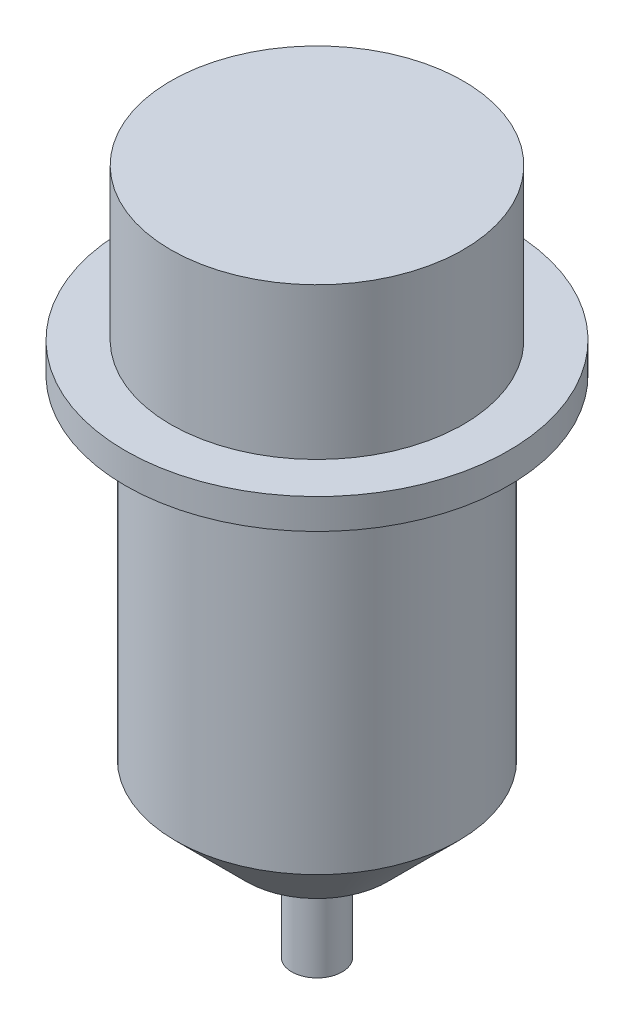
ISO-10303-21;
HEADER;
FILE_DESCRIPTION(('STEP AP214'),'2;1');
FILE_NAME('part.step','',(''),(''),'','','');
FILE_SCHEMA(('AUTOMOTIVE_DESIGN { 1 0 10303 214 1 1 1 1 }'));
ENDSEC;
DATA;
#1=APPLICATION_CONTEXT('core data for automotive mechanical design processes');
#2=APPLICATION_PROTOCOL_DEFINITION('international standard','automotive_design',2000,#1);
#3=PRODUCT_CONTEXT('',#1,'mechanical');
#4=PRODUCT('Part','Part','',(#3));
#5=PRODUCT_RELATED_PRODUCT_CATEGORY('part','',(#4));
#6=PRODUCT_DEFINITION_FORMATION('','',#4);
#7=PRODUCT_DEFINITION_CONTEXT('part definition',#1,'design');
#8=PRODUCT_DEFINITION('design','',#6,#7);
#9=PRODUCT_DEFINITION_SHAPE('','',#8);
#10=(LENGTH_UNIT() NAMED_UNIT(*) SI_UNIT(.MILLI.,.METRE.));
#11=(NAMED_UNIT(*) PLANE_ANGLE_UNIT() SI_UNIT($,.RADIAN.));
#12=(NAMED_UNIT(*) SI_UNIT($,.STERADIAN.) SOLID_ANGLE_UNIT());
#13=UNCERTAINTY_MEASURE_WITH_UNIT(LENGTH_MEASURE(1.E-05),#10,'distance_accuracy_value','');
#14=(GEOMETRIC_REPRESENTATION_CONTEXT(3) GLOBAL_UNCERTAINTY_ASSIGNED_CONTEXT((#13)) GLOBAL_UNIT_ASSIGNED_CONTEXT((#10,
#11,#12)) REPRESENTATION_CONTEXT('',''));
#15=CARTESIAN_POINT('',(0.,0.,0.));
#16=DIRECTION('',(0.,0.,1.));
#17=DIRECTION('',(1.,0.,0.));
#18=AXIS2_PLACEMENT_3D('',#15,#16,#17);
#19=CARTESIAN_POINT('',(0.,-40.,0.));
#20=DIRECTION('',(0.,1.,0.));
#21=DIRECTION('',(0.,0.,1.));
#22=AXIS2_PLACEMENT_3D('',#19,#20,#21);
#23=CYLINDRICAL_SURFACE('',#22,14.);
#24=CARTESIAN_POINT('',(0.,-33.,0.));
#25=DIRECTION('',(0.,1.,0.));
#26=DIRECTION('',(0.,0.,1.));
#27=AXIS2_PLACEMENT_3D('',#24,#25,#26);
#28=CIRCLE('',#27,14.);
#29=CARTESIAN_POINT('',(0.,-33.,14.));
#30=VERTEX_POINT('',#29);
#31=EDGE_CURVE('E71',#30,#30,#28,.T.);
#32=ORIENTED_EDGE('',*,*,#31,.T.);
#33=EDGE_LOOP('',(#32));
#34=FACE_BOUND('',#33,.T.);
#35=CARTESIAN_POINT('',(0.,0.,0.));
#36=DIRECTION('',(0.,1.,0.));
#37=DIRECTION('',(0.,0.,1.));
#38=AXIS2_PLACEMENT_3D('',#35,#36,#37);
#39=CIRCLE('',#38,14.);
#40=CARTESIAN_POINT('',(0.,0.,14.));
#41=VERTEX_POINT('',#40);
#42=EDGE_CURVE('E65',#41,#41,#39,.T.);
#43=ORIENTED_EDGE('',*,*,#42,.F.);
#44=EDGE_LOOP('',(#43));
#45=FACE_BOUND('',#44,.T.);
#46=ADVANCED_FACE('F37',(#34,#45),#23,.T.);
#47=CARTESIAN_POINT('',(0.,-40.,0.));
#48=DIRECTION('',(0.,1.,0.));
#49=DIRECTION('',(0.,0.,1.));
#50=AXIS2_PLACEMENT_3D('',#47,#48,#49);
#51=PLANE('',#50);
#52=CARTESIAN_POINT('',(0.,-40.,0.));
#53=DIRECTION('',(0.,-1.,0.));
#54=DIRECTION('',(0.,0.,-1.));
#55=AXIS2_PLACEMENT_3D('',#52,#53,#54);
#56=CIRCLE('',#55,2.5);
#57=CARTESIAN_POINT('',(0.,-40.,-2.5));
#58=VERTEX_POINT('',#57);
#59=EDGE_CURVE('E10',#58,#58,#56,.T.);
#60=ORIENTED_EDGE('',*,*,#59,.F.);
#61=EDGE_LOOP('',(#60));
#62=FACE_BOUND('',#61,.T.);
#63=CARTESIAN_POINT('',(0.,-40.,0.));
#64=DIRECTION('',(0.,1.,0.));
#65=DIRECTION('',(0.,0.,1.));
#66=AXIS2_PLACEMENT_3D('',#63,#64,#65);
#67=CIRCLE('',#66,6.99999999999998);
#68=CARTESIAN_POINT('',(0.,-40.,6.99999999999998));
#69=VERTEX_POINT('',#68);
#70=EDGE_CURVE('E41',#69,#69,#67,.F.);
#71=ORIENTED_EDGE('',*,*,#70,.T.);
#72=EDGE_LOOP('',(#71));
#73=FACE_BOUND('',#72,.T.);
#74=ADVANCED_FACE('F80',(#62,#73),#51,.F.);
#75=CARTESIAN_POINT('',(0.,-33.,0.));
#76=DIRECTION('',(0.,1.,0.));
#77=DIRECTION('',(0.,0.,1.));
#78=AXIS2_PLACEMENT_3D('',#75,#76,#77);
#79=CONICAL_SURFACE('',#78,14.,0.78539816339745);
#80=ORIENTED_EDGE('',*,*,#70,.F.);
#81=EDGE_LOOP('',(#80));
#82=FACE_BOUND('',#81,.T.);
#83=ORIENTED_EDGE('',*,*,#31,.F.);
#84=EDGE_LOOP('',(#83));
#85=FACE_BOUND('',#84,.T.);
#86=ADVANCED_FACE('F39',(#82,#85),#79,.T.);
#87=CARTESIAN_POINT('',(0.,3.,0.));
#88=DIRECTION('',(0.,-1.,0.));
#89=DIRECTION('',(0.,0.,-1.));
#90=AXIS2_PLACEMENT_3D('',#87,#88,#89);
#91=CYLINDRICAL_SURFACE('',#90,19.);
#92=CARTESIAN_POINT('',(0.,3.,0.));
#93=DIRECTION('',(0.,1.,0.));
#94=DIRECTION('',(0.,0.,1.));
#95=AXIS2_PLACEMENT_3D('',#92,#93,#94);
#96=CIRCLE('',#95,19.);
#97=CARTESIAN_POINT('',(0.,3.,19.));
#98=VERTEX_POINT('',#97);
#99=EDGE_CURVE('E61',#98,#98,#96,.T.);
#100=ORIENTED_EDGE('',*,*,#99,.F.);
#101=EDGE_LOOP('',(#100));
#102=FACE_BOUND('',#101,.T.);
#103=CARTESIAN_POINT('',(0.,0.,0.));
#104=DIRECTION('',(0.,1.,0.));
#105=DIRECTION('',(0.,0.,1.));
#106=AXIS2_PLACEMENT_3D('',#103,#104,#105);
#107=CIRCLE('',#106,19.);
#108=CARTESIAN_POINT('',(0.,0.,19.));
#109=VERTEX_POINT('',#108);
#110=EDGE_CURVE('E59',#109,#109,#107,.T.);
#111=ORIENTED_EDGE('',*,*,#110,.T.);
#112=EDGE_LOOP('',(#111));
#113=FACE_BOUND('',#112,.T.);
#114=ADVANCED_FACE('F84',(#102,#113),#91,.T.);
#115=CARTESIAN_POINT('',(0.,3.,0.));
#116=DIRECTION('',(0.,1.,0.));
#117=DIRECTION('',(0.,0.,1.));
#118=AXIS2_PLACEMENT_3D('',#115,#116,#117);
#119=PLANE('',#118);
#120=CARTESIAN_POINT('',(0.,3.,0.));
#121=DIRECTION('',(0.,1.,0.));
#122=DIRECTION('',(0.,0.,1.));
#123=AXIS2_PLACEMENT_3D('',#120,#121,#122);
#124=CIRCLE('',#123,14.5);
#125=CARTESIAN_POINT('',(0.,3.,14.5));
#126=VERTEX_POINT('',#125);
#127=EDGE_CURVE('E46',#126,#126,#124,.T.);
#128=ORIENTED_EDGE('',*,*,#127,.F.);
#129=EDGE_LOOP('',(#128));
#130=FACE_BOUND('',#129,.T.);
#131=ORIENTED_EDGE('',*,*,#99,.T.);
#132=EDGE_LOOP('',(#131));
#133=FACE_BOUND('',#132,.T.);
#134=ADVANCED_FACE('F89',(#130,#133),#119,.T.);
#135=CARTESIAN_POINT('',(0.,0.,0.));
#136=DIRECTION('',(0.,1.,0.));
#137=DIRECTION('',(0.,0.,1.));
#138=AXIS2_PLACEMENT_3D('',#135,#136,#137);
#139=PLANE('',#138);
#140=ORIENTED_EDGE('',*,*,#42,.T.);
#141=EDGE_LOOP('',(#140));
#142=FACE_BOUND('',#141,.T.);
#143=ORIENTED_EDGE('',*,*,#110,.F.);
#144=EDGE_LOOP('',(#143));
#145=FACE_BOUND('',#144,.T.);
#146=ADVANCED_FACE('F99',(#142,#145),#139,.F.);
#147=CARTESIAN_POINT('',(0.,18.,0.));
#148=DIRECTION('',(0.,-1.,0.));
#149=DIRECTION('',(0.,0.,-1.));
#150=AXIS2_PLACEMENT_3D('',#147,#148,#149);
#151=CYLINDRICAL_SURFACE('',#150,14.5);
#152=CARTESIAN_POINT('',(0.,18.,0.));
#153=DIRECTION('',(0.,1.,0.));
#154=DIRECTION('',(0.,0.,1.));
#155=AXIS2_PLACEMENT_3D('',#152,#153,#154);
#156=CIRCLE('',#155,14.5);
#157=CARTESIAN_POINT('',(0.,18.,14.5));
#158=VERTEX_POINT('',#157);
#159=EDGE_CURVE('E56',#158,#158,#156,.T.);
#160=ORIENTED_EDGE('',*,*,#159,.F.);
#161=EDGE_LOOP('',(#160));
#162=FACE_BOUND('',#161,.T.);
#163=ORIENTED_EDGE('',*,*,#127,.T.);
#164=EDGE_LOOP('',(#163));
#165=FACE_BOUND('',#164,.T.);
#166=ADVANCED_FACE('F102',(#162,#165),#151,.T.);
#167=CARTESIAN_POINT('',(0.,18.,0.));
#168=DIRECTION('',(0.,1.,0.));
#169=DIRECTION('',(0.,0.,1.));
#170=AXIS2_PLACEMENT_3D('',#167,#168,#169);
#171=PLANE('',#170);
#172=ORIENTED_EDGE('',*,*,#159,.T.);
#173=EDGE_LOOP('',(#172));
#174=FACE_BOUND('',#173,.T.);
#175=ADVANCED_FACE('F109',(#174),#171,.T.);
#176=CARTESIAN_POINT('',(0.,-50.,0.));
#177=DIRECTION('',(0.,1.,0.));
#178=DIRECTION('',(0.,0.,1.));
#179=AXIS2_PLACEMENT_3D('',#176,#177,#178);
#180=CYLINDRICAL_SURFACE('',#179,2.5);
#181=CARTESIAN_POINT('',(0.,-50.,0.));
#182=DIRECTION('',(0.,-1.,0.));
#183=DIRECTION('',(0.,0.,-1.));
#184=AXIS2_PLACEMENT_3D('',#181,#182,#183);
#185=CIRCLE('',#184,2.5);
#186=CARTESIAN_POINT('',(0.,-50.,-2.5));
#187=VERTEX_POINT('',#186);
#188=EDGE_CURVE('E55',#187,#187,#185,.T.);
#189=ORIENTED_EDGE('',*,*,#188,.F.);
#190=EDGE_LOOP('',(#189));
#191=FACE_BOUND('',#190,.T.);
#192=ORIENTED_EDGE('',*,*,#59,.T.);
#193=EDGE_LOOP('',(#192));
#194=FACE_BOUND('',#193,.T.);
#195=ADVANCED_FACE('F113',(#191,#194),#180,.T.);
#196=CARTESIAN_POINT('',(0.,-50.,0.));
#197=DIRECTION('',(0.,-1.,0.));
#198=DIRECTION('',(0.,0.,-1.));
#199=AXIS2_PLACEMENT_3D('',#196,#197,#198);
#200=PLANE('',#199);
#201=ORIENTED_EDGE('',*,*,#188,.T.);
#202=EDGE_LOOP('',(#201));
#203=FACE_BOUND('',#202,.T.);
#204=ADVANCED_FACE('F117',(#203),#200,.T.);
#205=CLOSED_SHELL('',(#46,#74,#86,#114,#134,#146,#166,#175,#195,#204));
#206=MANIFOLD_SOLID_BREP('B2',#205);
#207=ADVANCED_BREP_SHAPE_REPRESENTATION('',(#18,#206),#14);
#208=SHAPE_DEFINITION_REPRESENTATION(#9,#207);
ENDSEC;
END-ISO-10303-21;
